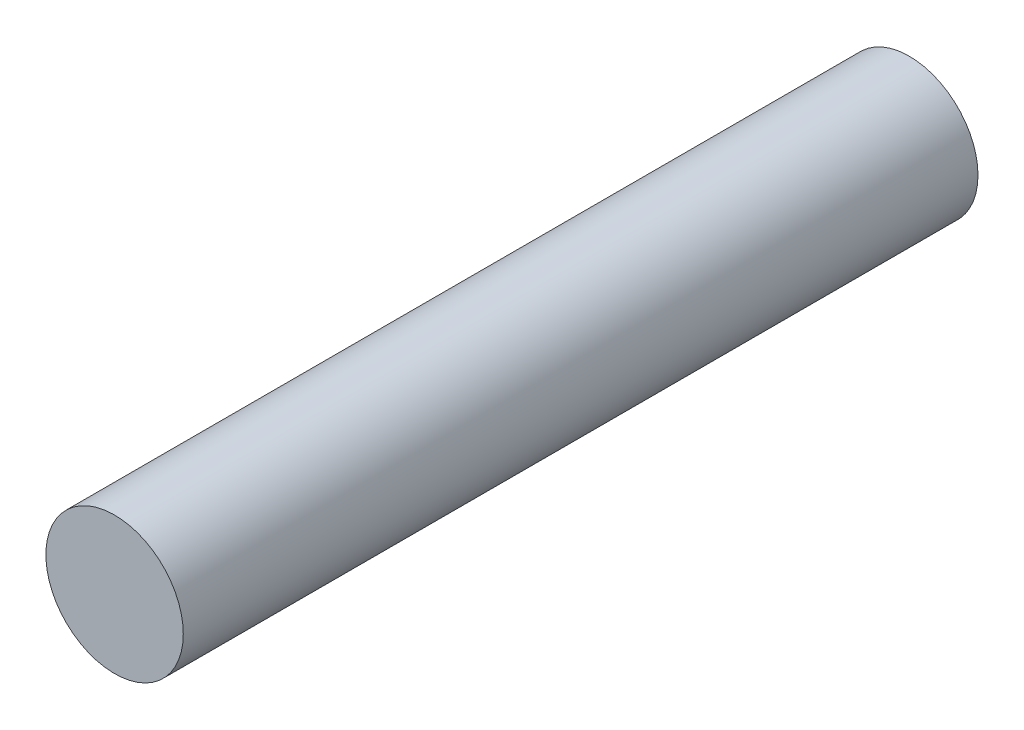
ISO-10303-21;
HEADER;
FILE_DESCRIPTION(('STEP AP214'),'2;1');
FILE_NAME('part.step','',(''),(''),'','','');
FILE_SCHEMA(('AUTOMOTIVE_DESIGN { 1 0 10303 214 1 1 1 1 }'));
ENDSEC;
DATA;
#1=APPLICATION_CONTEXT('core data for automotive mechanical design processes');
#2=APPLICATION_PROTOCOL_DEFINITION('international standard','automotive_design',2000,#1);
#3=PRODUCT_CONTEXT('',#1,'mechanical');
#4=PRODUCT('Part','Part','',(#3));
#5=PRODUCT_RELATED_PRODUCT_CATEGORY('part','',(#4));
#6=PRODUCT_DEFINITION_FORMATION('','',#4);
#7=PRODUCT_DEFINITION_CONTEXT('part definition',#1,'design');
#8=PRODUCT_DEFINITION('design','',#6,#7);
#9=PRODUCT_DEFINITION_SHAPE('','',#8);
#10=(LENGTH_UNIT() NAMED_UNIT(*) SI_UNIT(.MILLI.,.METRE.));
#11=(NAMED_UNIT(*) PLANE_ANGLE_UNIT() SI_UNIT($,.RADIAN.));
#12=(NAMED_UNIT(*) SI_UNIT($,.STERADIAN.) SOLID_ANGLE_UNIT());
#13=UNCERTAINTY_MEASURE_WITH_UNIT(LENGTH_MEASURE(1.E-05),#10,'distance_accuracy_value','');
#14=(GEOMETRIC_REPRESENTATION_CONTEXT(3) GLOBAL_UNCERTAINTY_ASSIGNED_CONTEXT((#13)) GLOBAL_UNIT_ASSIGNED_CONTEXT((#10,
#11,#12)) REPRESENTATION_CONTEXT('',''));
#15=CARTESIAN_POINT('',(0.,0.,0.));
#16=DIRECTION('',(0.,0.,1.));
#17=DIRECTION('',(1.,0.,0.));
#18=AXIS2_PLACEMENT_3D('',#15,#16,#17);
#19=CARTESIAN_POINT('',(0.,0.,-538.396823027775));
#20=DIRECTION('',(0.,0.,1.));
#21=DIRECTION('',(1.,0.,0.));
#22=AXIS2_PLACEMENT_3D('',#19,#20,#21);
#23=CYLINDRICAL_SURFACE('',#22,46.5);
#24=CARTESIAN_POINT('',(0.,0.,-538.396823027775));
#25=DIRECTION('',(0.,0.,1.));
#26=DIRECTION('',(1.,0.,0.));
#27=AXIS2_PLACEMENT_3D('',#24,#25,#26);
#28=CIRCLE('',#27,46.5);
#29=CARTESIAN_POINT('',(46.5,0.,-538.396823027775));
#30=VERTEX_POINT('',#29);
#31=EDGE_CURVE('E10',#30,#30,#28,.T.);
#32=ORIENTED_EDGE('',*,*,#31,.T.);
#33=EDGE_LOOP('',(#32));
#34=FACE_BOUND('',#33,.T.);
#35=CARTESIAN_POINT('',(0.,0.,-0.521366245724664));
#36=DIRECTION('',(0.,0.,1.));
#37=DIRECTION('',(1.,0.,0.));
#38=AXIS2_PLACEMENT_3D('',#35,#36,#37);
#39=CIRCLE('',#38,46.5);
#40=CARTESIAN_POINT('',(46.5,0.,-0.521366245724664));
#41=VERTEX_POINT('',#40);
#42=EDGE_CURVE('E45',#41,#41,#39,.T.);
#43=ORIENTED_EDGE('',*,*,#42,.F.);
#44=EDGE_LOOP('',(#43));
#45=FACE_BOUND('',#44,.T.);
#46=ADVANCED_FACE('F38',(#34,#45),#23,.T.);
#47=CARTESIAN_POINT('',(0.,0.,-538.396823027775));
#48=DIRECTION('',(0.,0.,1.));
#49=DIRECTION('',(1.,0.,0.));
#50=AXIS2_PLACEMENT_3D('',#47,#48,#49);
#51=PLANE('',#50);
#52=ORIENTED_EDGE('',*,*,#31,.F.);
#53=EDGE_LOOP('',(#52));
#54=FACE_BOUND('',#53,.T.);
#55=ADVANCED_FACE('F55',(#54),#51,.F.);
#56=CARTESIAN_POINT('',(0.,0.,-0.521366245724664));
#57=DIRECTION('',(0.,0.,1.));
#58=DIRECTION('',(1.,0.,0.));
#59=AXIS2_PLACEMENT_3D('',#56,#57,#58);
#60=PLANE('',#59);
#61=ORIENTED_EDGE('',*,*,#42,.T.);
#62=EDGE_LOOP('',(#61));
#63=FACE_BOUND('',#62,.T.);
#64=ADVANCED_FACE('F52',(#63),#60,.T.);
#65=CLOSED_SHELL('',(#46,#55,#64));
#66=MANIFOLD_SOLID_BREP('B2',#65);
#67=ADVANCED_BREP_SHAPE_REPRESENTATION('',(#18,#66),#14);
#68=SHAPE_DEFINITION_REPRESENTATION(#9,#67);
ENDSEC;
END-ISO-10303-21;
